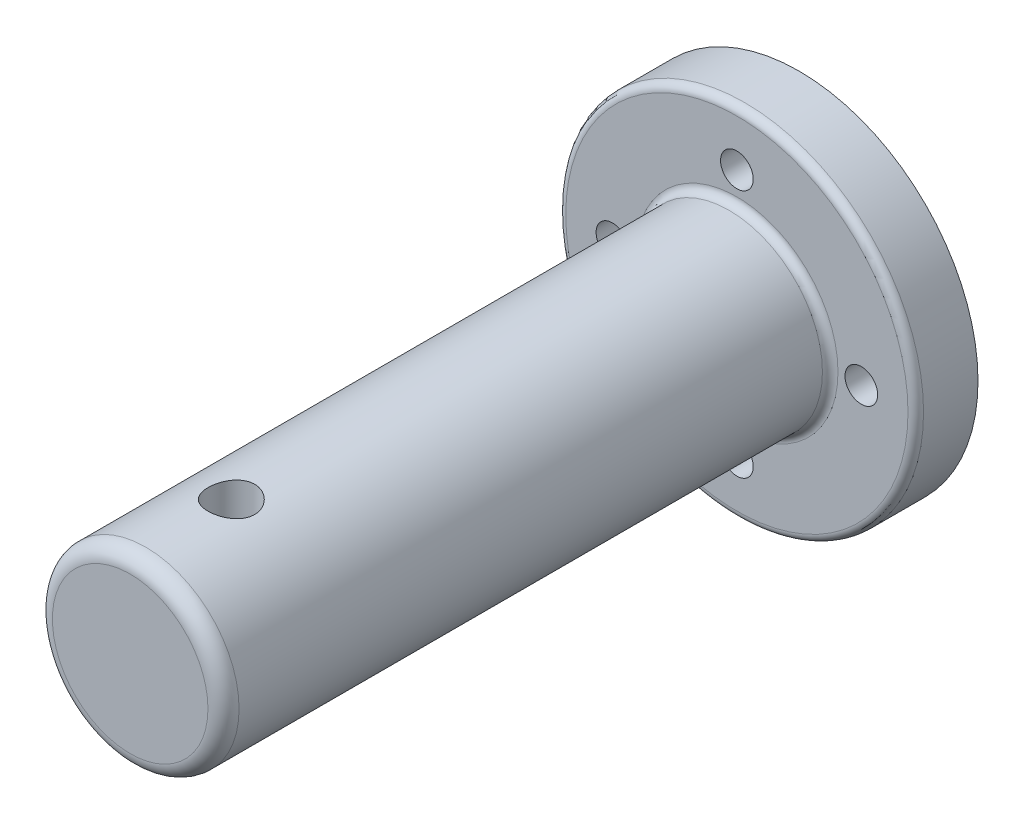
ISO-10303-21;
HEADER;
FILE_DESCRIPTION(('STEP AP214'),'2;1');
FILE_NAME('part.step','',(''),(''),'','','');
FILE_SCHEMA(('AUTOMOTIVE_DESIGN { 1 0 10303 214 1 1 1 1 }'));
ENDSEC;
DATA;
#1=APPLICATION_CONTEXT('core data for automotive mechanical design processes');
#2=APPLICATION_PROTOCOL_DEFINITION('international standard','automotive_design',2000,#1);
#3=PRODUCT_CONTEXT('',#1,'mechanical');
#4=PRODUCT('Part','Part','',(#3));
#5=PRODUCT_RELATED_PRODUCT_CATEGORY('part','',(#4));
#6=PRODUCT_DEFINITION_FORMATION('','',#4);
#7=PRODUCT_DEFINITION_CONTEXT('part definition',#1,'design');
#8=PRODUCT_DEFINITION('design','',#6,#7);
#9=PRODUCT_DEFINITION_SHAPE('','',#8);
#10=(LENGTH_UNIT() NAMED_UNIT(*) SI_UNIT(.MILLI.,.METRE.));
#11=(NAMED_UNIT(*) PLANE_ANGLE_UNIT() SI_UNIT($,.RADIAN.));
#12=(NAMED_UNIT(*) SI_UNIT($,.STERADIAN.) SOLID_ANGLE_UNIT());
#13=UNCERTAINTY_MEASURE_WITH_UNIT(LENGTH_MEASURE(1.E-05),#10,'distance_accuracy_value','');
#14=(GEOMETRIC_REPRESENTATION_CONTEXT(3) GLOBAL_UNCERTAINTY_ASSIGNED_CONTEXT((#13)) GLOBAL_UNIT_ASSIGNED_CONTEXT((#10,
#11,#12)) REPRESENTATION_CONTEXT('',''));
#15=CARTESIAN_POINT('',(0.,0.,0.));
#16=DIRECTION('',(0.,0.,1.));
#17=DIRECTION('',(1.,0.,0.));
#18=AXIS2_PLACEMENT_3D('',#15,#16,#17);
#19=CARTESIAN_POINT('',(0.,8.,4.));
#20=DIRECTION('',(0.,0.,-1.));
#21=DIRECTION('',(-1.,0.,0.));
#22=AXIS2_PLACEMENT_3D('',#19,#20,#21);
#23=CYLINDRICAL_SURFACE('',#22,1.05);
#24=CARTESIAN_POINT('',(0.,8.,4.));
#25=DIRECTION('',(0.,0.,1.));
#26=DIRECTION('',(1.,0.,0.));
#27=AXIS2_PLACEMENT_3D('',#24,#25,#26);
#28=CIRCLE('',#27,1.05);
#29=CARTESIAN_POINT('',(1.05,8.,4.));
#30=VERTEX_POINT('',#29);
#31=EDGE_CURVE('E205',#30,#30,#28,.T.);
#32=ORIENTED_EDGE('',*,*,#31,.T.);
#33=EDGE_LOOP('',(#32));
#34=FACE_BOUND('',#33,.T.);
#35=CARTESIAN_POINT('',(0.,8.,0.));
#36=DIRECTION('',(0.,0.,1.));
#37=DIRECTION('',(1.,0.,0.));
#38=AXIS2_PLACEMENT_3D('',#35,#36,#37);
#39=CIRCLE('',#38,1.05);
#40=CARTESIAN_POINT('',(1.05,8.,0.));
#41=VERTEX_POINT('',#40);
#42=EDGE_CURVE('E210',#41,#41,#39,.T.);
#43=ORIENTED_EDGE('',*,*,#42,.F.);
#44=EDGE_LOOP('',(#43));
#45=FACE_BOUND('',#44,.T.);
#46=ADVANCED_FACE('F45',(#34,#45),#23,.F.);
#47=CARTESIAN_POINT('',(8.,0.,4.));
#48=DIRECTION('',(0.,0.,-1.));
#49=DIRECTION('',(-1.,0.,0.));
#50=AXIS2_PLACEMENT_3D('',#47,#48,#49);
#51=CYLINDRICAL_SURFACE('',#50,1.05);
#52=CARTESIAN_POINT('',(8.,0.,4.));
#53=DIRECTION('',(0.,0.,1.));
#54=DIRECTION('',(1.,0.,0.));
#55=AXIS2_PLACEMENT_3D('',#52,#53,#54);
#56=CIRCLE('',#55,1.05);
#57=CARTESIAN_POINT('',(9.05,0.,4.));
#58=VERTEX_POINT('',#57);
#59=EDGE_CURVE('E363',#58,#58,#56,.T.);
#60=ORIENTED_EDGE('',*,*,#59,.T.);
#61=EDGE_LOOP('',(#60));
#62=FACE_BOUND('',#61,.T.);
#63=CARTESIAN_POINT('',(8.,0.,0.));
#64=DIRECTION('',(0.,0.,1.));
#65=DIRECTION('',(1.,0.,0.));
#66=AXIS2_PLACEMENT_3D('',#63,#64,#65);
#67=CIRCLE('',#66,1.05);
#68=CARTESIAN_POINT('',(9.05,0.,0.));
#69=VERTEX_POINT('',#68);
#70=EDGE_CURVE('E202',#69,#69,#67,.T.);
#71=ORIENTED_EDGE('',*,*,#70,.F.);
#72=EDGE_LOOP('',(#71));
#73=FACE_BOUND('',#72,.T.);
#74=ADVANCED_FACE('F154',(#62,#73),#51,.F.);
#75=CARTESIAN_POINT('',(0.,-8.,4.));
#76=DIRECTION('',(0.,0.,-1.));
#77=DIRECTION('',(-1.,0.,0.));
#78=AXIS2_PLACEMENT_3D('',#75,#76,#77);
#79=CYLINDRICAL_SURFACE('',#78,1.05);
#80=CARTESIAN_POINT('',(0.,-8.,4.));
#81=DIRECTION('',(0.,0.,1.));
#82=DIRECTION('',(1.,0.,0.));
#83=AXIS2_PLACEMENT_3D('',#80,#81,#82);
#84=CIRCLE('',#83,1.05);
#85=CARTESIAN_POINT('',(1.04999999999994,-8.,4.));
#86=VERTEX_POINT('',#85);
#87=EDGE_CURVE('E359',#86,#86,#84,.T.);
#88=ORIENTED_EDGE('',*,*,#87,.T.);
#89=EDGE_LOOP('',(#88));
#90=FACE_BOUND('',#89,.T.);
#91=CARTESIAN_POINT('',(0.,-8.,0.));
#92=DIRECTION('',(0.,0.,1.));
#93=DIRECTION('',(1.,0.,0.));
#94=AXIS2_PLACEMENT_3D('',#91,#92,#93);
#95=CIRCLE('',#94,1.05);
#96=CARTESIAN_POINT('',(1.04999999999994,-8.,0.));
#97=VERTEX_POINT('',#96);
#98=EDGE_CURVE('E197',#97,#97,#95,.T.);
#99=ORIENTED_EDGE('',*,*,#98,.F.);
#100=EDGE_LOOP('',(#99));
#101=FACE_BOUND('',#100,.T.);
#102=ADVANCED_FACE('F158',(#90,#101),#79,.F.);
#103=CARTESIAN_POINT('',(-8.,0.,4.));
#104=DIRECTION('',(0.,0.,-1.));
#105=DIRECTION('',(-1.,0.,0.));
#106=AXIS2_PLACEMENT_3D('',#103,#104,#105);
#107=CYLINDRICAL_SURFACE('',#106,1.05);
#108=CARTESIAN_POINT('',(-8.,0.,4.));
#109=DIRECTION('',(0.,0.,1.));
#110=DIRECTION('',(1.,0.,0.));
#111=AXIS2_PLACEMENT_3D('',#108,#109,#110);
#112=CIRCLE('',#111,1.05);
#113=CARTESIAN_POINT('',(-6.95,0.,4.));
#114=VERTEX_POINT('',#113);
#115=EDGE_CURVE('E216',#114,#114,#112,.T.);
#116=ORIENTED_EDGE('',*,*,#115,.T.);
#117=EDGE_LOOP('',(#116));
#118=FACE_BOUND('',#117,.T.);
#119=CARTESIAN_POINT('',(-8.,0.,0.));
#120=DIRECTION('',(0.,0.,1.));
#121=DIRECTION('',(1.,0.,0.));
#122=AXIS2_PLACEMENT_3D('',#119,#120,#121);
#123=CIRCLE('',#122,1.05);
#124=CARTESIAN_POINT('',(-6.95,0.,0.));
#125=VERTEX_POINT('',#124);
#126=EDGE_CURVE('E195',#125,#125,#123,.T.);
#127=ORIENTED_EDGE('',*,*,#126,.F.);
#128=EDGE_LOOP('',(#127));
#129=FACE_BOUND('',#128,.T.);
#130=ADVANCED_FACE('F150',(#118,#129),#107,.F.);
#131=CARTESIAN_POINT('',(0.,0.,4.));
#132=DIRECTION('',(0.,0.,-1.));
#133=DIRECTION('',(-1.,0.,0.));
#134=AXIS2_PLACEMENT_3D('',#131,#132,#133);
#135=CYLINDRICAL_SURFACE('',#134,11.5);
#136=CARTESIAN_POINT('',(0.,0.,3.5));
#137=DIRECTION('',(0.,0.,1.));
#138=DIRECTION('',(1.,0.,0.));
#139=AXIS2_PLACEMENT_3D('',#136,#137,#138);
#140=CIRCLE('',#139,11.5);
#141=CARTESIAN_POINT('',(11.5,0.,3.5));
#142=VERTEX_POINT('',#141);
#143=EDGE_CURVE('E223',#142,#142,#140,.F.);
#144=ORIENTED_EDGE('',*,*,#143,.T.);
#145=EDGE_LOOP('',(#144));
#146=FACE_BOUND('',#145,.T.);
#147=CARTESIAN_POINT('',(0.,0.,0.));
#148=DIRECTION('',(0.,0.,1.));
#149=DIRECTION('',(1.,0.,0.));
#150=AXIS2_PLACEMENT_3D('',#147,#148,#149);
#151=CIRCLE('',#150,11.5);
#152=CARTESIAN_POINT('',(11.5,0.,0.));
#153=VERTEX_POINT('',#152);
#154=EDGE_CURVE('E213',#153,#153,#151,.T.);
#155=ORIENTED_EDGE('',*,*,#154,.T.);
#156=EDGE_LOOP('',(#155));
#157=FACE_BOUND('',#156,.T.);
#158=ADVANCED_FACE('F144',(#146,#157),#135,.T.);
#159=CARTESIAN_POINT('',(0.,0.,4.));
#160=DIRECTION('',(0.,0.,1.));
#161=DIRECTION('',(1.,0.,0.));
#162=AXIS2_PLACEMENT_3D('',#159,#160,#161);
#163=PLANE('',#162);
#164=CARTESIAN_POINT('',(0.,0.,4.));
#165=DIRECTION('',(0.,0.,1.));
#166=DIRECTION('',(1.,0.,0.));
#167=AXIS2_PLACEMENT_3D('',#164,#165,#166);
#168=CIRCLE('',#167,11.);
#169=CARTESIAN_POINT('',(11.,0.,4.));
#170=VERTEX_POINT('',#169);
#171=EDGE_CURVE('E220',#170,#170,#168,.T.);
#172=ORIENTED_EDGE('',*,*,#171,.T.);
#173=EDGE_LOOP('',(#172));
#174=FACE_BOUND('',#173,.T.);
#175=CARTESIAN_POINT('',(0.,0.,4.));
#176=DIRECTION('',(0.,0.,1.));
#177=DIRECTION('',(1.,0.,0.));
#178=AXIS2_PLACEMENT_3D('',#175,#176,#177);
#179=CIRCLE('',#178,6.5);
#180=CARTESIAN_POINT('',(6.5,0.,4.));
#181=VERTEX_POINT('',#180);
#182=EDGE_CURVE('E217',#181,#181,#179,.F.);
#183=ORIENTED_EDGE('',*,*,#182,.T.);
#184=EDGE_LOOP('',(#183));
#185=FACE_BOUND('',#184,.T.);
#186=ORIENTED_EDGE('',*,*,#115,.F.);
#187=EDGE_LOOP('',(#186));
#188=FACE_BOUND('',#187,.T.);
#189=ORIENTED_EDGE('',*,*,#87,.F.);
#190=EDGE_LOOP('',(#189));
#191=FACE_BOUND('',#190,.T.);
#192=ORIENTED_EDGE('',*,*,#59,.F.);
#193=EDGE_LOOP('',(#192));
#194=FACE_BOUND('',#193,.T.);
#195=ORIENTED_EDGE('',*,*,#31,.F.);
#196=EDGE_LOOP('',(#195));
#197=FACE_BOUND('',#196,.T.);
#198=ADVANCED_FACE('F140',(#174,#185,#188,#191,#194,#197),#163,.T.);
#199=CARTESIAN_POINT('',(0.,0.,0.));
#200=DIRECTION('',(0.,0.,1.));
#201=DIRECTION('',(1.,0.,0.));
#202=AXIS2_PLACEMENT_3D('',#199,#200,#201);
#203=PLANE('',#202);
#204=CARTESIAN_POINT('',(0.,0.,0.));
#205=DIRECTION('',(0.,0.,1.));
#206=DIRECTION('',(1.,0.,0.));
#207=AXIS2_PLACEMENT_3D('',#204,#205,#206);
#208=CIRCLE('',#207,5.25);
#209=CARTESIAN_POINT('',(5.25,0.,0.));
#210=VERTEX_POINT('',#209);
#211=EDGE_CURVE('E67',#210,#210,#208,.T.);
#212=ORIENTED_EDGE('',*,*,#211,.T.);
#213=EDGE_LOOP('',(#212));
#214=FACE_BOUND('',#213,.T.);
#215=ORIENTED_EDGE('',*,*,#126,.T.);
#216=EDGE_LOOP('',(#215));
#217=FACE_BOUND('',#216,.T.);
#218=ORIENTED_EDGE('',*,*,#98,.T.);
#219=EDGE_LOOP('',(#218));
#220=FACE_BOUND('',#219,.T.);
#221=ORIENTED_EDGE('',*,*,#70,.T.);
#222=EDGE_LOOP('',(#221));
#223=FACE_BOUND('',#222,.T.);
#224=ORIENTED_EDGE('',*,*,#42,.T.);
#225=EDGE_LOOP('',(#224));
#226=FACE_BOUND('',#225,.T.);
#227=ORIENTED_EDGE('',*,*,#154,.F.);
#228=EDGE_LOOP('',(#227));
#229=FACE_BOUND('',#228,.T.);
#230=ADVANCED_FACE('F138',(#214,#217,#220,#223,#226,#229),#203,.F.);
#231=CARTESIAN_POINT('',(0.,0.,43.));
#232=DIRECTION('',(0.,0.,-1.));
#233=DIRECTION('',(-1.,0.,0.));
#234=AXIS2_PLACEMENT_3D('',#231,#232,#233);
#235=CYLINDRICAL_SURFACE('',#234,6.);
#236=CARTESIAN_POINT('',(0.,-6.,38.));
#237=CARTESIAN_POINT('',(0.0828760886697315,-5.99999859868013,37.9999976742618));
#238=CARTESIAN_POINT('',(0.165778157830764,-5.99826578131828,37.9931084492262));
#239=CARTESIAN_POINT('',(0.329206323770533,-5.99152113829892,37.965774848693));
#240=CARTESIAN_POINT('',(0.40973104687074,-5.98650745419968,37.9453227904621));
#241=CARTESIAN_POINT('',(0.566020872182579,-5.9737562633204,37.8915607465379));
#242=CARTESIAN_POINT('',(0.641791563430005,-5.96602202842087,37.8582662012847));
#243=CARTESIAN_POINT('',(0.786672131904428,-5.94865343807593,37.7798186099552));
#244=CARTESIAN_POINT('',(0.855781784348762,-5.9390190185405,37.7346651638811));
#245=CARTESIAN_POINT('',(0.986801927300923,-5.91867413591801,37.6327992103458));
#246=CARTESIAN_POINT('',(1.04855569006107,-5.90794707148533,37.5758884250408));
#247=CARTESIAN_POINT('',(1.16174892720331,-5.88673620117529,37.4525477950911));
#248=CARTESIAN_POINT('',(1.21318723694914,-5.87625242288348,37.3861168770535));
#249=CARTESIAN_POINT('',(1.30502654279903,-5.8565477569971,37.2444047732626));
#250=CARTESIAN_POINT('',(1.34525221592536,-5.84734794470605,37.1690067691896));
#251=CARTESIAN_POINT('',(1.41239690855053,-5.83149494812223,37.0122515883416));
#252=CARTESIAN_POINT('',(1.43931805543933,-5.82484135672789,36.9308953666742));
#253=CARTESIAN_POINT('',(1.47855483680429,-5.81500476717551,36.7662565017975));
#254=CARTESIAN_POINT('',(1.49115226833334,-5.81175491075426,36.6830451039502));
#255=CARTESIAN_POINT('',(1.50226177506785,-5.80889362537741,36.515631430986));
#256=CARTESIAN_POINT('',(1.50077614181798,-5.80928160448644,36.4314293193014));
#257=CARTESIAN_POINT('',(1.48398652463928,-5.81359205496618,36.2665841922555));
#258=CARTESIAN_POINT('',(1.46901834019052,-5.81742863001879,36.1859043785349));
#259=CARTESIAN_POINT('',(1.42622418690311,-5.82806709676484,36.0282389490887));
#260=CARTESIAN_POINT('',(1.39839730206943,-5.83486919970696,35.951253596971));
#261=CARTESIAN_POINT('',(1.33038947793716,-5.85075113904187,35.8022619837479));
#262=CARTESIAN_POINT('',(1.29008666723291,-5.85985327469421,35.7303138282104));
#263=CARTESIAN_POINT('',(1.19835627601495,-5.87929710846386,35.5940812902432));
#264=CARTESIAN_POINT('',(1.14692674880884,-5.88963902334735,35.5297982519327));
#265=CARTESIAN_POINT('',(1.03266342468122,-5.91075880539781,35.4087963843056));
#266=CARTESIAN_POINT('',(0.969546258165858,-5.92154069477971,35.3523455099386));
#267=CARTESIAN_POINT('',(0.834611917503701,-5.94205965578786,35.2507787575361));
#268=CARTESIAN_POINT('',(0.762794477707945,-5.95179669549415,35.2056632257364));
#269=CARTESIAN_POINT('',(0.612115888681392,-5.96917732094182,35.1279494137756));
#270=CARTESIAN_POINT('',(0.533231393208623,-5.97681360127725,35.0953946597456));
#271=CARTESIAN_POINT('',(0.37087600814288,-5.98907916991419,35.0440826942904));
#272=CARTESIAN_POINT('',(0.287405999150481,-5.99370903339281,35.0253228435819));
#273=CARTESIAN_POINT('',(0.120539970390023,-5.99935499271375,35.0025424344412));
#274=CARTESIAN_POINT('',(0.0371967199882068,-6.00046053508279,34.9981569739247));
#275=CARTESIAN_POINT('',(-0.12903287480151,-5.99918804814451,35.0032490020555));
#276=CARTESIAN_POINT('',(-0.211919259644596,-5.99681033241847,35.0127252427991));
#277=CARTESIAN_POINT('',(-0.373614268776493,-5.98889581127357,35.0449709083914));
#278=CARTESIAN_POINT('',(-0.452465118968756,-5.98340634185811,35.067541263477));
#279=CARTESIAN_POINT('',(-0.605257292452513,-5.96988706634134,35.1251070840284));
#280=CARTESIAN_POINT('',(-0.679198119032635,-5.96185700369892,35.1601038043132));
#281=CARTESIAN_POINT('',(-0.821523134429848,-5.9439330792631,35.2422361288747));
#282=CARTESIAN_POINT('',(-0.889785441835833,-5.93400867366932,35.2895761123968));
#283=CARTESIAN_POINT('',(-1.01752661364325,-5.91344509187419,35.394789908797));
#284=CARTESIAN_POINT('',(-1.07700395897301,-5.90280579251705,35.4526655396169));
#285=CARTESIAN_POINT('',(-1.18699056807273,-5.88168956960771,35.5790019608445));
#286=CARTESIAN_POINT('',(-1.23724386762203,-5.87122304187281,35.6476877030024));
#287=CARTESIAN_POINT('',(-1.3255107590127,-5.85192878377239,35.7927326344657));
#288=CARTESIAN_POINT('',(-1.36352489415794,-5.84310098067026,35.8690914829598));
#289=CARTESIAN_POINT('',(-1.42595142060929,-5.82818094734665,36.0269057224131));
#290=CARTESIAN_POINT('',(-1.45044439665407,-5.82207255291906,36.108327628344));
#291=CARTESIAN_POINT('',(-1.48534565995378,-5.81326744090183,36.2743096378891));
#292=CARTESIAN_POINT('',(-1.49575702747866,-5.81056997719936,36.3588690510325));
#293=CARTESIAN_POINT('',(-1.50203859033399,-5.80894901203957,36.5261210238552));
#294=CARTESIAN_POINT('',(-1.49831789778012,-5.80991932728264,36.6087974351247));
#295=CARTESIAN_POINT('',(-1.47737727831287,-5.81527909007843,36.772303888668));
#296=CARTESIAN_POINT('',(-1.46015762268677,-5.81966846891857,36.8531339680136));
#297=CARTESIAN_POINT('',(-1.4129313194428,-5.83131260682723,37.0102084590654));
#298=CARTESIAN_POINT('',(-1.38300140468038,-5.8385501523631,37.0864773052402));
#299=CARTESIAN_POINT('',(-1.31126491360507,-5.85507755724829,37.2329653827137));
#300=CARTESIAN_POINT('',(-1.26945669003419,-5.86436770120773,37.3031837731869));
#301=CARTESIAN_POINT('',(-1.17386774863714,-5.88425634263512,37.437554629002));
#302=CARTESIAN_POINT('',(-1.11980316291226,-5.89488264831757,37.501501073424));
#303=CARTESIAN_POINT('',(-1.00178937118973,-5.91608027246286,37.6195470447954));
#304=CARTESIAN_POINT('',(-0.937837821261143,-5.9266515772706,37.673644230113));
#305=CARTESIAN_POINT('',(-0.800467586702587,-5.94677655647663,37.7714113085646));
#306=CARTESIAN_POINT('',(-0.726898422316384,-5.95630833365868,37.8148746136716));
#307=CARTESIAN_POINT('',(-0.573266059510475,-5.97304924975119,37.8887474629405));
#308=CARTESIAN_POINT('',(-0.493207563436738,-5.98026005199781,37.9191663606485));
#309=CARTESIAN_POINT('',(-0.344410253243471,-5.99048059565542,37.9615718303297));
#310=CARTESIAN_POINT('',(-0.276380170908068,-5.99402585052691,37.9759512430534));
#311=CARTESIAN_POINT('',(-0.138906071536283,-5.99878605231948,37.9951659436219));
#312=CARTESIAN_POINT('',(-0.0694621612426162,-6.00000117450894,38.0000019493053));
#313=CARTESIAN_POINT('',(0.,-6.,38.));
#314=B_SPLINE_CURVE_WITH_KNOTS('',3,(#236,#237,#238,#239,#240,#241,#242,#243,#244,#245,#246,
#247,#248,#249,#250,#251,#252,#253,#254,#255,#256,#257,#258,#259,#260,#261,#262,#263,#264,#265,
#266,#267,#268,#269,#270,#271,#272,#273,#274,#275,#276,#277,#278,#279,#280,#281,#282,#283,#284,
#285,#286,#287,#288,#289,#290,#291,#292,#293,#294,#295,#296,#297,#298,#299,#300,#301,#302,#303,
#304,#305,#306,#307,#308,#309,#310,#311,#312,#313),.UNSPECIFIED.,.T.,.F.,(4,2,2,2,2,2,2,2,2,2,2,
2,2,2,2,2,2,2,2,2,2,2,2,2,2,2,2,2,2,2,2,2,2,2,2,2,2,2,4),(0.,0.248373712471891,0.4968882377639,
0.74510490228611,0.993329940169332,1.2461443543714,1.49898729580062,1.75558647545807,
2.01214461169369,2.2635629509943,2.51494038112697,2.76022497007017,3.00552703466038,
3.25330527873879,3.50112690836163,3.7560150096902,4.01091089558247,4.26668229009114,
4.52240473688643,4.77158308949277,5.02073901112743,5.26620274514038,5.51169127322291,
5.76153587565352,6.01142363008019,6.26744509204477,6.52345518749509,6.77792254614037,
7.03233423252409,7.27943780398613,7.52653640956034,7.77216400559448,8.01782568136901,
8.26989576409911,8.52202569770418,8.77872185499588,9.0352336382135,9.24342242942149,
9.4515955604304),.UNSPECIFIED.);
#315=CARTESIAN_POINT('',(0.,-6.,38.));
#316=VERTEX_POINT('',#315);
#317=EDGE_CURVE('E53',#316,#316,#314,.T.);
#318=ORIENTED_EDGE('',*,*,#317,.T.);
#319=EDGE_LOOP('',(#318));
#320=FACE_BOUND('',#319,.T.);
#321=CARTESIAN_POINT('',(0.,6.,38.));
#322=CARTESIAN_POINT('',(-0.0828760886697315,5.99999859868013,37.9999976742618));
#323=CARTESIAN_POINT('',(-0.165778157830764,5.99826578131828,37.9931084492262));
#324=CARTESIAN_POINT('',(-0.329206323770533,5.99152113829892,37.965774848693));
#325=CARTESIAN_POINT('',(-0.40973104687074,5.98650745419968,37.9453227904621));
#326=CARTESIAN_POINT('',(-0.566020872182579,5.9737562633204,37.8915607465379));
#327=CARTESIAN_POINT('',(-0.641791563430005,5.96602202842087,37.8582662012847));
#328=CARTESIAN_POINT('',(-0.786672131904428,5.94865343807593,37.7798186099552));
#329=CARTESIAN_POINT('',(-0.855781784348762,5.9390190185405,37.7346651638811));
#330=CARTESIAN_POINT('',(-0.986801927300923,5.91867413591801,37.6327992103458));
#331=CARTESIAN_POINT('',(-1.04855569006107,5.90794707148533,37.5758884250408));
#332=CARTESIAN_POINT('',(-1.16174892720331,5.88673620117529,37.4525477950911));
#333=CARTESIAN_POINT('',(-1.21318723694914,5.87625242288348,37.3861168770535));
#334=CARTESIAN_POINT('',(-1.30502654279903,5.8565477569971,37.2444047732626));
#335=CARTESIAN_POINT('',(-1.34525221592536,5.84734794470605,37.1690067691896));
#336=CARTESIAN_POINT('',(-1.41239690855053,5.83149494812223,37.0122515883416));
#337=CARTESIAN_POINT('',(-1.43931805543933,5.82484135672789,36.9308953666742));
#338=CARTESIAN_POINT('',(-1.47855483680429,5.81500476717551,36.7662565017975));
#339=CARTESIAN_POINT('',(-1.49115226833334,5.81175491075426,36.6830451039502));
#340=CARTESIAN_POINT('',(-1.50226177506785,5.80889362537741,36.515631430986));
#341=CARTESIAN_POINT('',(-1.50077614181798,5.80928160448644,36.4314293193014));
#342=CARTESIAN_POINT('',(-1.48398652463928,5.81359205496618,36.2665841922555));
#343=CARTESIAN_POINT('',(-1.46901834019052,5.81742863001879,36.1859043785349));
#344=CARTESIAN_POINT('',(-1.42622418690311,5.82806709676484,36.0282389490887));
#345=CARTESIAN_POINT('',(-1.39839730206943,5.83486919970696,35.951253596971));
#346=CARTESIAN_POINT('',(-1.33038947793716,5.85075113904187,35.8022619837479));
#347=CARTESIAN_POINT('',(-1.29008666723291,5.85985327469421,35.7303138282104));
#348=CARTESIAN_POINT('',(-1.19835627601495,5.87929710846386,35.5940812902432));
#349=CARTESIAN_POINT('',(-1.14692674880884,5.88963902334735,35.5297982519327));
#350=CARTESIAN_POINT('',(-1.03266342468122,5.91075880539781,35.4087963843056));
#351=CARTESIAN_POINT('',(-0.969546258165858,5.92154069477971,35.3523455099386));
#352=CARTESIAN_POINT('',(-0.834611917503701,5.94205965578786,35.2507787575361));
#353=CARTESIAN_POINT('',(-0.762794477707945,5.95179669549415,35.2056632257364));
#354=CARTESIAN_POINT('',(-0.612115888681392,5.96917732094182,35.1279494137756));
#355=CARTESIAN_POINT('',(-0.533231393208623,5.97681360127725,35.0953946597456));
#356=CARTESIAN_POINT('',(-0.37087600814288,5.98907916991419,35.0440826942904));
#357=CARTESIAN_POINT('',(-0.287405999150481,5.99370903339281,35.0253228435819));
#358=CARTESIAN_POINT('',(-0.120539970390023,5.99935499271375,35.0025424344412));
#359=CARTESIAN_POINT('',(-0.0371967199882068,6.00046053508279,34.9981569739247));
#360=CARTESIAN_POINT('',(0.12903287480151,5.99918804814451,35.0032490020555));
#361=CARTESIAN_POINT('',(0.211919259644596,5.99681033241847,35.0127252427991));
#362=CARTESIAN_POINT('',(0.373614268776493,5.98889581127357,35.0449709083914));
#363=CARTESIAN_POINT('',(0.452465118968756,5.98340634185811,35.067541263477));
#364=CARTESIAN_POINT('',(0.605257292452513,5.96988706634134,35.1251070840284));
#365=CARTESIAN_POINT('',(0.679198119032635,5.96185700369892,35.1601038043132));
#366=CARTESIAN_POINT('',(0.821523134429848,5.9439330792631,35.2422361288747));
#367=CARTESIAN_POINT('',(0.889785441835833,5.93400867366932,35.2895761123968));
#368=CARTESIAN_POINT('',(1.01752661364325,5.91344509187419,35.394789908797));
#369=CARTESIAN_POINT('',(1.07700395897301,5.90280579251705,35.4526655396169));
#370=CARTESIAN_POINT('',(1.18699056807273,5.88168956960771,35.5790019608445));
#371=CARTESIAN_POINT('',(1.23724386762203,5.87122304187281,35.6476877030024));
#372=CARTESIAN_POINT('',(1.3255107590127,5.85192878377239,35.7927326344657));
#373=CARTESIAN_POINT('',(1.36352489415794,5.84310098067026,35.8690914829598));
#374=CARTESIAN_POINT('',(1.42595142060929,5.82818094734665,36.0269057224131));
#375=CARTESIAN_POINT('',(1.45044439665407,5.82207255291906,36.108327628344));
#376=CARTESIAN_POINT('',(1.48534565995378,5.81326744090183,36.2743096378891));
#377=CARTESIAN_POINT('',(1.49575702747866,5.81056997719936,36.3588690510325));
#378=CARTESIAN_POINT('',(1.50203859033399,5.80894901203957,36.5261210238552));
#379=CARTESIAN_POINT('',(1.49831789778012,5.80991932728264,36.6087974351247));
#380=CARTESIAN_POINT('',(1.47737727831287,5.81527909007843,36.772303888668));
#381=CARTESIAN_POINT('',(1.46015762268677,5.81966846891857,36.8531339680136));
#382=CARTESIAN_POINT('',(1.4129313194428,5.83131260682723,37.0102084590654));
#383=CARTESIAN_POINT('',(1.38300140468038,5.8385501523631,37.0864773052402));
#384=CARTESIAN_POINT('',(1.31126491360507,5.85507755724829,37.2329653827137));
#385=CARTESIAN_POINT('',(1.26945669003419,5.86436770120773,37.3031837731869));
#386=CARTESIAN_POINT('',(1.17386774863714,5.88425634263512,37.437554629002));
#387=CARTESIAN_POINT('',(1.11980316291226,5.89488264831757,37.501501073424));
#388=CARTESIAN_POINT('',(1.00178937118973,5.91608027246286,37.6195470447954));
#389=CARTESIAN_POINT('',(0.937837821261143,5.9266515772706,37.673644230113));
#390=CARTESIAN_POINT('',(0.800467586702587,5.94677655647663,37.7714113085646));
#391=CARTESIAN_POINT('',(0.726898422316384,5.95630833365868,37.8148746136716));
#392=CARTESIAN_POINT('',(0.573266059510475,5.97304924975119,37.8887474629405));
#393=CARTESIAN_POINT('',(0.493207563436738,5.98026005199781,37.9191663606485));
#394=CARTESIAN_POINT('',(0.344410253243471,5.99048059565542,37.9615718303297));
#395=CARTESIAN_POINT('',(0.276380170908068,5.99402585052691,37.9759512430534));
#396=CARTESIAN_POINT('',(0.138906071536283,5.99878605231948,37.9951659436219));
#397=CARTESIAN_POINT('',(0.0694621612426162,6.00000117450894,38.0000019493053));
#398=CARTESIAN_POINT('',(0.,6.,38.));
#399=B_SPLINE_CURVE_WITH_KNOTS('',3,(#321,#322,#323,#324,#325,#326,#327,#328,#329,#330,#331,
#332,#333,#334,#335,#336,#337,#338,#339,#340,#341,#342,#343,#344,#345,#346,#347,#348,#349,#350,
#351,#352,#353,#354,#355,#356,#357,#358,#359,#360,#361,#362,#363,#364,#365,#366,#367,#368,#369,
#370,#371,#372,#373,#374,#375,#376,#377,#378,#379,#380,#381,#382,#383,#384,#385,#386,#387,#388,
#389,#390,#391,#392,#393,#394,#395,#396,#397,#398),.UNSPECIFIED.,.T.,.F.,(4,2,2,2,2,2,2,2,2,2,2,
2,2,2,2,2,2,2,2,2,2,2,2,2,2,2,2,2,2,2,2,2,2,2,2,2,2,2,4),(0.,0.248373712471891,0.4968882377639,
0.74510490228611,0.993329940169332,1.2461443543714,1.49898729580062,1.75558647545807,
2.01214461169369,2.2635629509943,2.51494038112697,2.76022497007017,3.00552703466038,
3.25330527873879,3.50112690836163,3.7560150096902,4.01091089558247,4.26668229009114,
4.52240473688643,4.77158308949277,5.02073901112743,5.26620274514038,5.51169127322291,
5.76153587565352,6.01142363008019,6.26744509204477,6.52345518749509,6.77792254614037,
7.03233423252409,7.27943780398613,7.52653640956034,7.77216400559448,8.01782568136901,
8.26989576409911,8.52202569770418,8.77872185499588,9.0352336382135,9.24342242942149,
9.4515955604304),.UNSPECIFIED.);
#400=CARTESIAN_POINT('',(0.,6.,38.));
#401=VERTEX_POINT('',#400);
#402=EDGE_CURVE('E124',#401,#401,#399,.T.);
#403=ORIENTED_EDGE('',*,*,#402,.T.);
#404=EDGE_LOOP('',(#403));
#405=FACE_BOUND('',#404,.T.);
#406=CARTESIAN_POINT('',(0.,0.,42.));
#407=DIRECTION('',(0.,0.,1.));
#408=DIRECTION('',(1.,0.,0.));
#409=AXIS2_PLACEMENT_3D('',#406,#407,#408);
#410=CIRCLE('',#409,6.);
#411=CARTESIAN_POINT('',(6.,0.,42.));
#412=VERTEX_POINT('',#411);
#413=EDGE_CURVE('E77',#412,#412,#410,.F.);
#414=ORIENTED_EDGE('',*,*,#413,.T.);
#415=EDGE_LOOP('',(#414));
#416=FACE_BOUND('',#415,.T.);
#417=CARTESIAN_POINT('',(0.,0.,4.5));
#418=DIRECTION('',(0.,0.,1.));
#419=DIRECTION('',(1.,0.,0.));
#420=AXIS2_PLACEMENT_3D('',#417,#418,#419);
#421=CIRCLE('',#420,6.);
#422=CARTESIAN_POINT('',(6.,0.,4.5));
#423=VERTEX_POINT('',#422);
#424=EDGE_CURVE('E226',#423,#423,#421,.T.);
#425=ORIENTED_EDGE('',*,*,#424,.T.);
#426=EDGE_LOOP('',(#425));
#427=FACE_BOUND('',#426,.T.);
#428=ADVANCED_FACE('F134',(#320,#405,#416,#427),#235,.T.);
#429=CARTESIAN_POINT('',(0.,0.,43.));
#430=DIRECTION('',(0.,0.,1.));
#431=DIRECTION('',(1.,0.,0.));
#432=AXIS2_PLACEMENT_3D('',#429,#430,#431);
#433=PLANE('',#432);
#434=CARTESIAN_POINT('',(0.,0.,43.));
#435=DIRECTION('',(0.,0.,1.));
#436=DIRECTION('',(1.,0.,0.));
#437=AXIS2_PLACEMENT_3D('',#434,#435,#436);
#438=CIRCLE('',#437,5.);
#439=CARTESIAN_POINT('',(5.,0.,43.));
#440=VERTEX_POINT('',#439);
#441=EDGE_CURVE('E229',#440,#440,#438,.T.);
#442=ORIENTED_EDGE('',*,*,#441,.T.);
#443=EDGE_LOOP('',(#442));
#444=FACE_BOUND('',#443,.T.);
#445=ADVANCED_FACE('F101',(#444),#433,.T.);
#446=CARTESIAN_POINT('',(0.,0.,9.));
#447=DIRECTION('',(0.,0.,-1.));
#448=DIRECTION('',(-1.,0.,0.));
#449=AXIS2_PLACEMENT_3D('',#446,#447,#448);
#450=CYLINDRICAL_SURFACE('',#449,4.25);
#451=CARTESIAN_POINT('',(-4.25,0.,2.));
#452=CARTESIAN_POINT('',(-4.25,0.556323668797347,2.));
#453=CARTESIAN_POINT('',(-4.13938386425417,1.11242853649843,2.));
#454=CARTESIAN_POINT('',(-3.71359216209177,2.14038063860483,2.));
#455=CARTESIAN_POINT('',(-3.39858405878381,2.61182358130185,2.));
#456=CARTESIAN_POINT('',(-2.61182358130185,3.39858405878381,2.));
#457=CARTESIAN_POINT('',(-2.14038063860481,3.71359216209177,2.));
#458=CARTESIAN_POINT('',(-1.11242853649845,4.13938386425416,2.));
#459=CARTESIAN_POINT('',(-0.556323668797074,4.25,2.));
#460=CARTESIAN_POINT('',(0.556323668797073,4.25,2.));
#461=CARTESIAN_POINT('',(1.11242853649847,4.13938386425415,2.));
#462=CARTESIAN_POINT('',(2.14038063860479,3.71359216209178,2.));
#463=CARTESIAN_POINT('',(2.61182358130185,3.39858405878381,2.));
#464=CARTESIAN_POINT('',(3.39858405878381,2.61182358130184,2.));
#465=CARTESIAN_POINT('',(3.71359216209176,2.14038063860484,2.));
#466=CARTESIAN_POINT('',(4.13938386425417,1.11242853649844,2.));
#467=CARTESIAN_POINT('',(4.25,0.556323668797074,2.));
#468=CARTESIAN_POINT('',(4.25,-0.556323668797073,2.));
#469=CARTESIAN_POINT('',(4.13938386425417,-1.11242853649843,2.));
#470=CARTESIAN_POINT('',(3.71359216209177,-2.14038063860482,2.));
#471=CARTESIAN_POINT('',(3.39858405878378,-2.61182358130187,2.));
#472=CARTESIAN_POINT('',(2.61182358130187,-3.39858405878379,2.));
#473=CARTESIAN_POINT('',(2.14038063860482,-3.71359216209177,2.));
#474=CARTESIAN_POINT('',(1.11242853649845,-4.13938386425416,2.));
#475=CARTESIAN_POINT('',(0.556323668797067,-4.25,2.));
#476=CARTESIAN_POINT('',(-0.556323668797081,-4.25,2.));
#477=CARTESIAN_POINT('',(-1.1124285364984,-4.13938386425418,2.));
#478=CARTESIAN_POINT('',(-2.14038063860485,-3.71359216209176,2.));
#479=CARTESIAN_POINT('',(-2.61182358130187,-3.39858405878378,2.));
#480=CARTESIAN_POINT('',(-3.39858405878377,-2.61182358130189,2.));
#481=CARTESIAN_POINT('',(-3.71359216209175,-2.14038063860486,2.));
#482=CARTESIAN_POINT('',(-4.13938386425418,-1.11242853649841,2.));
#483=CARTESIAN_POINT('',(-4.25,-0.556323668797348,2.));
#484=CARTESIAN_POINT('',(-4.25,0.,2.));
#485=(BOUNDED_CURVE() B_SPLINE_CURVE(3,(#451,#452,#453,#454,#455,#456,#457,#458,#459,#460,#461,
#462,#463,#464,#465,#466,#467,#468,#469,#470,#471,#472,#473,#474,#475,#476,#477,#478,#479,#480,
#481,#482,#483,#484),.UNSPECIFIED.,.T.,.F.) B_SPLINE_CURVE_WITH_KNOTS((4,2,2,2,2,2,2,2,2,2,2,2,
2,2,2,2,4),(0.,0.392699081698724,0.785398163397448,1.17809724509617,1.5707963267949,
1.96349540849362,2.35619449019234,2.74889357189107,3.14159265358979,3.53429173528852,
3.92699081698724,4.31968989868597,4.71238898038469,5.10508806208341,5.49778714378214,
5.89048622548086,6.28318530717959),
.UNSPECIFIED.) CURVE() GEOMETRIC_REPRESENTATION_ITEM() RATIONAL_B_SPLINE_CURVE((1.,1.,1.,1.,1.,
1.,1.,1.,1.,1.,1.,1.,1.,1.,1.,1.,1.,1.,1.,1.,1.,1.,1.,1.,1.,1.,1.,1.,1.,1.,1.,1.,1.,1.)) REPRESENTATION_ITEM(''));
#486=CARTESIAN_POINT('',(-4.25,0.,2.));
#487=VERTEX_POINT('',#486);
#488=EDGE_CURVE('E11',#487,#487,#485,.F.);
#489=ORIENTED_EDGE('',*,*,#488,.T.);
#490=EDGE_LOOP('',(#489));
#491=FACE_BOUND('',#490,.T.);
#492=CARTESIAN_POINT('',(0.,0.,0.999999999999999));
#493=DIRECTION('',(0.,0.,1.));
#494=DIRECTION('',(1.,0.,0.));
#495=AXIS2_PLACEMENT_3D('',#492,#493,#494);
#496=CIRCLE('',#495,4.25);
#497=CARTESIAN_POINT('',(4.25,0.,0.999999999999999));
#498=VERTEX_POINT('',#497);
#499=EDGE_CURVE('E72',#498,#498,#496,.F.);
#500=ORIENTED_EDGE('',*,*,#499,.T.);
#501=EDGE_LOOP('',(#500));
#502=FACE_BOUND('',#501,.T.);
#503=ADVANCED_FACE('F95',(#491,#502),#450,.F.);
#504=CARTESIAN_POINT('',(0.,0.,9.));
#505=DIRECTION('',(0.,0.,-1.));
#506=DIRECTION('',(-1.,0.,0.));
#507=AXIS2_PLACEMENT_3D('',#504,#505,#506);
#508=PLANE('',#507);
#509=CARTESIAN_POINT('',(-1.75,0.,9.));
#510=CARTESIAN_POINT('',(-1.75,-0.229074451857732,9.));
#511=CARTESIAN_POINT('',(-1.70445217939878,-0.458058809146412,9.));
#512=CARTESIAN_POINT('',(-1.52912618439072,-0.881333204131407,9.));
#513=CARTESIAN_POINT('',(-1.39941696538156,-1.07545676877138,9.));
#514=CARTESIAN_POINT('',(-1.07545676877135,-1.39941696538155,9.));
#515=CARTESIAN_POINT('',(-0.881333204131402,-1.52912618439073,9.));
#516=CARTESIAN_POINT('',(-0.458058809146407,-1.70445217939878,9.));
#517=CARTESIAN_POINT('',(-0.229074451857622,-1.75,9.));
#518=CARTESIAN_POINT('',(0.229074451857616,-1.75,9.));
#519=CARTESIAN_POINT('',(0.458058809146412,-1.70445217939878,9.));
#520=CARTESIAN_POINT('',(0.881333204131407,-1.52912618439072,9.));
#521=CARTESIAN_POINT('',(1.07545676877135,-1.39941696538157,9.));
#522=CARTESIAN_POINT('',(1.39941696538157,-1.07545676877135,9.));
#523=CARTESIAN_POINT('',(1.52912618439073,-0.881333204131405,9.));
#524=CARTESIAN_POINT('',(1.70445217939877,-0.458058809146404,9.));
#525=CARTESIAN_POINT('',(1.75,-0.229074451857618,9.));
#526=CARTESIAN_POINT('',(1.75,0.229074451857619,9.));
#527=CARTESIAN_POINT('',(1.70445217939877,0.458058809146409,9.));
#528=CARTESIAN_POINT('',(1.52912618439073,0.88133320413141,9.));
#529=CARTESIAN_POINT('',(1.39941696538157,1.07545676877135,9.));
#530=CARTESIAN_POINT('',(1.07545676877135,1.39941696538157,9.));
#531=CARTESIAN_POINT('',(0.881333204131401,1.52912618439074,9.));
#532=CARTESIAN_POINT('',(0.458058809146415,1.70445217939876,9.));
#533=CARTESIAN_POINT('',(0.229074451857618,1.75,9.));
#534=CARTESIAN_POINT('',(-0.229074451857619,1.75,9.));
#535=CARTESIAN_POINT('',(-0.458058809146414,1.70445217939876,9.));
#536=CARTESIAN_POINT('',(-0.881333204131399,1.52912618439074,9.));
#537=CARTESIAN_POINT('',(-1.07545676877135,1.39941696538159,9.));
#538=CARTESIAN_POINT('',(-1.39941696538156,1.07545676877133,9.));
#539=CARTESIAN_POINT('',(-1.52912618439075,0.881333204131416,9.));
#540=CARTESIAN_POINT('',(-1.70445217939875,0.458058809146398,9.));
#541=CARTESIAN_POINT('',(-1.75,0.229074451857731,9.));
#542=CARTESIAN_POINT('',(-1.75,0.,9.));
#543=(BOUNDED_CURVE() B_SPLINE_CURVE(3,(#509,#510,#511,#512,#513,#514,#515,#516,#517,#518,#519,
#520,#521,#522,#523,#524,#525,#526,#527,#528,#529,#530,#531,#532,#533,#534,#535,#536,#537,#538,
#539,#540,#541,#542),.UNSPECIFIED.,.T.,.F.) B_SPLINE_CURVE_WITH_KNOTS((4,2,2,2,2,2,2,2,2,2,2,2,
2,2,2,2,4),(0.,0.392699081698725,0.785398163397448,1.17809724509617,1.5707963267949,
1.96349540849362,2.35619449019234,2.74889357189107,3.14159265358979,3.53429173528852,
3.92699081698724,4.31968989868597,4.71238898038469,5.10508806208341,5.49778714378214,
5.89048622548086,6.28318530717959),
.UNSPECIFIED.) CURVE() GEOMETRIC_REPRESENTATION_ITEM() RATIONAL_B_SPLINE_CURVE((1.,1.,1.,1.,1.,
1.,1.,1.,1.,1.,1.,1.,1.,1.,1.,1.,1.,1.,1.,1.,1.,1.,1.,1.,1.,1.,1.,1.,1.,1.,1.,1.,1.,1.)) REPRESENTATION_ITEM(''));
#544=CARTESIAN_POINT('',(-1.75,0.,9.));
#545=VERTEX_POINT('',#544);
#546=EDGE_CURVE('E62',#545,#545,#543,.F.);
#547=ORIENTED_EDGE('',*,*,#546,.T.);
#548=EDGE_LOOP('',(#547));
#549=FACE_BOUND('',#548,.T.);
#550=ADVANCED_FACE('F85',(#549),#508,.T.);
#551=CARTESIAN_POINT('',(0.,0.,3.5));
#552=DIRECTION('',(0.,0.,1.));
#553=DIRECTION('',(1.,0.,0.));
#554=AXIS2_PLACEMENT_3D('',#551,#552,#553);
#555=TOROIDAL_SURFACE('',#554,11.,0.5);
#556=ORIENTED_EDGE('',*,*,#143,.F.);
#557=EDGE_LOOP('',(#556));
#558=FACE_BOUND('',#557,.T.);
#559=ORIENTED_EDGE('',*,*,#171,.F.);
#560=EDGE_LOOP('',(#559));
#561=FACE_BOUND('',#560,.T.);
#562=ADVANCED_FACE('F94',(#558,#561),#555,.T.);
#563=CARTESIAN_POINT('',(0.,0.,4.5));
#564=DIRECTION('',(0.,0.,1.));
#565=DIRECTION('',(1.,0.,0.));
#566=AXIS2_PLACEMENT_3D('',#563,#564,#565);
#567=TOROIDAL_SURFACE('',#566,6.5,0.5);
#568=ORIENTED_EDGE('',*,*,#182,.F.);
#569=EDGE_LOOP('',(#568));
#570=FACE_BOUND('',#569,.T.);
#571=ORIENTED_EDGE('',*,*,#424,.F.);
#572=EDGE_LOOP('',(#571));
#573=FACE_BOUND('',#572,.T.);
#574=ADVANCED_FACE('F168',(#570,#573),#567,.F.);
#575=CARTESIAN_POINT('',(0.,0.,42.));
#576=DIRECTION('',(0.,0.,1.));
#577=DIRECTION('',(1.,0.,0.));
#578=AXIS2_PLACEMENT_3D('',#575,#576,#577);
#579=TOROIDAL_SURFACE('',#578,5.,1.);
#580=ORIENTED_EDGE('',*,*,#413,.F.);
#581=EDGE_LOOP('',(#580));
#582=FACE_BOUND('',#581,.T.);
#583=ORIENTED_EDGE('',*,*,#441,.F.);
#584=EDGE_LOOP('',(#583));
#585=FACE_BOUND('',#584,.T.);
#586=ADVANCED_FACE('F172',(#582,#585),#579,.T.);
#587=CARTESIAN_POINT('',(0.,0.,0.999999999999999));
#588=DIRECTION('',(0.,0.,1.));
#589=DIRECTION('',(1.,0.,0.));
#590=AXIS2_PLACEMENT_3D('',#587,#588,#589);
#591=TOROIDAL_SURFACE('',#590,5.25,1.);
#592=ORIENTED_EDGE('',*,*,#211,.F.);
#593=EDGE_LOOP('',(#592));
#594=FACE_BOUND('',#593,.T.);
#595=ORIENTED_EDGE('',*,*,#499,.F.);
#596=EDGE_LOOP('',(#595));
#597=FACE_BOUND('',#596,.T.);
#598=ADVANCED_FACE('F175',(#594,#597),#591,.T.);
#599=CARTESIAN_POINT('',(-1.75,0.,9.));
#600=CARTESIAN_POINT('',(-1.75,0.229074451857731,9.));
#601=CARTESIAN_POINT('',(-1.70445217939875,0.458058809146398,9.));
#602=CARTESIAN_POINT('',(-1.52912618439075,0.881333204131416,9.));
#603=CARTESIAN_POINT('',(-1.39941696538156,1.07545676877133,9.));
#604=CARTESIAN_POINT('',(-1.07545676877135,1.39941696538159,9.));
#605=CARTESIAN_POINT('',(-0.881333204131399,1.52912618439074,9.));
#606=CARTESIAN_POINT('',(-0.458058809146414,1.70445217939876,9.));
#607=CARTESIAN_POINT('',(-0.229074451857619,1.75,9.));
#608=CARTESIAN_POINT('',(0.229074451857618,1.75,9.));
#609=CARTESIAN_POINT('',(0.458058809146415,1.70445217939876,9.));
#610=CARTESIAN_POINT('',(0.881333204131401,1.52912618439074,9.));
#611=CARTESIAN_POINT('',(1.07545676877135,1.39941696538157,9.));
#612=CARTESIAN_POINT('',(1.39941696538157,1.07545676877135,9.));
#613=CARTESIAN_POINT('',(1.52912618439073,0.88133320413141,9.));
#614=CARTESIAN_POINT('',(1.70445217939877,0.458058809146409,9.));
#615=CARTESIAN_POINT('',(1.75,0.229074451857619,9.));
#616=CARTESIAN_POINT('',(1.75,-0.229074451857618,9.));
#617=CARTESIAN_POINT('',(1.70445217939877,-0.458058809146404,9.));
#618=CARTESIAN_POINT('',(1.52912618439073,-0.881333204131405,9.));
#619=CARTESIAN_POINT('',(1.39941696538157,-1.07545676877135,9.));
#620=CARTESIAN_POINT('',(1.07545676877135,-1.39941696538157,9.));
#621=CARTESIAN_POINT('',(0.881333204131407,-1.52912618439072,9.));
#622=CARTESIAN_POINT('',(0.458058809146412,-1.70445217939878,9.));
#623=CARTESIAN_POINT('',(0.229074451857616,-1.75,9.));
#624=CARTESIAN_POINT('',(-0.229074451857622,-1.75,9.));
#625=CARTESIAN_POINT('',(-0.458058809146407,-1.70445217939878,9.));
#626=CARTESIAN_POINT('',(-0.881333204131402,-1.52912618439073,9.));
#627=CARTESIAN_POINT('',(-1.07545676877135,-1.39941696538155,9.));
#628=CARTESIAN_POINT('',(-1.39941696538156,-1.07545676877138,9.));
#629=CARTESIAN_POINT('',(-1.52912618439072,-0.881333204131407,9.));
#630=CARTESIAN_POINT('',(-1.70445217939878,-0.458058809146412,9.));
#631=CARTESIAN_POINT('',(-1.75,-0.229074451857732,9.));
#632=CARTESIAN_POINT('',(-1.75,0.,9.));
#633=CARTESIAN_POINT('',(-4.25,0.,9.));
#634=CARTESIAN_POINT('',(-4.2500000000001,0.556323668797347,9.));
#635=CARTESIAN_POINT('',(-4.1393838642542,1.11242853649844,9.));
#636=CARTESIAN_POINT('',(-3.71359216209174,2.14038063860482,9.));
#637=CARTESIAN_POINT('',(-3.39858405878381,2.61182358130185,9.0000000000004));
#638=CARTESIAN_POINT('',(-2.61182358130185,3.39858405878381,8.9999999999996));
#639=CARTESIAN_POINT('',(-2.14038063860482,3.71359216209178,9.));
#640=CARTESIAN_POINT('',(-1.11242853649844,4.13938386425416,9.));
#641=CARTESIAN_POINT('',(-0.556323668797074,4.25,8.9999999999998));
#642=CARTESIAN_POINT('',(0.556323668797073,4.25,9.0000000000002));
#643=CARTESIAN_POINT('',(1.1124285364985,4.13938386425425,9.0000000000002));
#644=CARTESIAN_POINT('',(2.14038063860477,3.71359216209168,8.9999999999998));
#645=CARTESIAN_POINT('',(2.61182358130187,3.39858405878378,9.0000000000002));
#646=CARTESIAN_POINT('',(3.39858405878379,2.61182358130187,8.9999999999998));
#647=CARTESIAN_POINT('',(3.7135921620919,2.14038063860482,9.0000000000002));
#648=CARTESIAN_POINT('',(4.13938386425404,1.11242853649845,8.9999999999998));
#649=CARTESIAN_POINT('',(4.25,0.556323668797074,9.));
#650=CARTESIAN_POINT('',(4.25,-0.556323668797073,9.));
#651=CARTESIAN_POINT('',(4.13938386425434,-1.11242853649846,9.0000000000004));
#652=CARTESIAN_POINT('',(3.7135921620916,-2.14038063860479,8.9999999999996));
#653=CARTESIAN_POINT('',(3.39858405878378,-2.61182358130187,9.));
#654=CARTESIAN_POINT('',(2.61182358130187,-3.39858405878379,9.));
#655=CARTESIAN_POINT('',(2.14038063860482,-3.71359216209166,8.9999999999998));
#656=CARTESIAN_POINT('',(1.11242853649845,-4.13938386425427,9.0000000000002));
#657=CARTESIAN_POINT('',(0.556323668797067,-4.25,9.0000000000002));
#658=CARTESIAN_POINT('',(-0.556323668797081,-4.25,8.9999999999998));
#659=CARTESIAN_POINT('',(-1.11242853649844,-4.13938386425427,9.0000000000004));
#660=CARTESIAN_POINT('',(-2.14038063860481,-3.71359216209167,8.9999999999996));
#661=CARTESIAN_POINT('',(-2.61182358130187,-3.39858405878378,9.));
#662=CARTESIAN_POINT('',(-3.39858405878377,-2.61182358130189,9.));
#663=CARTESIAN_POINT('',(-3.71359216209166,-2.14038063860485,8.9999999999998));
#664=CARTESIAN_POINT('',(-4.13938386425427,-1.11242853649843,9.0000000000002));
#665=CARTESIAN_POINT('',(-4.2499999999999,-0.556323668797348,9.));
#666=CARTESIAN_POINT('',(-4.25,0.,9.));
#667=CARTESIAN_POINT('',(-4.25,0.,2.));
#668=CARTESIAN_POINT('',(-4.25,0.556323668797347,2.));
#669=CARTESIAN_POINT('',(-4.13938386425417,1.11242853649843,2.));
#670=CARTESIAN_POINT('',(-3.71359216209177,2.14038063860483,2.));
#671=CARTESIAN_POINT('',(-3.39858405878381,2.61182358130185,2.));
#672=CARTESIAN_POINT('',(-2.61182358130185,3.39858405878381,2.));
#673=CARTESIAN_POINT('',(-2.14038063860481,3.71359216209177,2.));
#674=CARTESIAN_POINT('',(-1.11242853649845,4.13938386425416,2.));
#675=CARTESIAN_POINT('',(-0.556323668797074,4.25,2.));
#676=CARTESIAN_POINT('',(0.556323668797073,4.25,2.));
#677=CARTESIAN_POINT('',(1.11242853649847,4.13938386425415,2.));
#678=CARTESIAN_POINT('',(2.14038063860479,3.71359216209178,2.));
#679=CARTESIAN_POINT('',(2.61182358130185,3.39858405878381,2.));
#680=CARTESIAN_POINT('',(3.39858405878381,2.61182358130184,2.));
#681=CARTESIAN_POINT('',(3.71359216209176,2.14038063860484,2.));
#682=CARTESIAN_POINT('',(4.13938386425417,1.11242853649844,2.));
#683=CARTESIAN_POINT('',(4.25,0.556323668797074,2.));
#684=CARTESIAN_POINT('',(4.25,-0.556323668797073,2.));
#685=CARTESIAN_POINT('',(4.13938386425417,-1.11242853649843,2.));
#686=CARTESIAN_POINT('',(3.71359216209177,-2.14038063860482,2.));
#687=CARTESIAN_POINT('',(3.39858405878378,-2.61182358130187,2.));
#688=CARTESIAN_POINT('',(2.61182358130187,-3.39858405878379,2.));
#689=CARTESIAN_POINT('',(2.14038063860482,-3.71359216209177,2.));
#690=CARTESIAN_POINT('',(1.11242853649845,-4.13938386425416,2.));
#691=CARTESIAN_POINT('',(0.556323668797067,-4.25,2.));
#692=CARTESIAN_POINT('',(-0.556323668797081,-4.25,2.));
#693=CARTESIAN_POINT('',(-1.1124285364984,-4.13938386425418,2.));
#694=CARTESIAN_POINT('',(-2.14038063860485,-3.71359216209176,2.));
#695=CARTESIAN_POINT('',(-2.61182358130187,-3.39858405878378,2.));
#696=CARTESIAN_POINT('',(-3.39858405878377,-2.61182358130189,2.));
#697=CARTESIAN_POINT('',(-3.71359216209175,-2.14038063860486,2.));
#698=CARTESIAN_POINT('',(-4.13938386425418,-1.11242853649841,2.));
#699=CARTESIAN_POINT('',(-4.25,-0.556323668797348,2.));
#700=CARTESIAN_POINT('',(-4.25,0.,2.));
#701=(BOUNDED_SURFACE() B_SPLINE_SURFACE(2,3,((#599,#600,#601,#602,#603,#604,#605,#606,#607,
#608,#609,#610,#611,#612,#613,#614,#615,#616,#617,#618,#619,#620,#621,#622,#623,#624,#625,#626,
#627,#628,#629,#630,#631,#632),(#633,#634,#635,#636,#637,#638,#639,#640,#641,#642,#643,#644,
#645,#646,#647,#648,#649,#650,#651,#652,#653,#654,#655,#656,#657,#658,#659,#660,#661,#662,#663,
#664,#665,#666),(#667,#668,#669,#670,#671,#672,#673,#674,#675,#676,#677,#678,#679,#680,#681,
#682,#683,#684,#685,#686,#687,#688,#689,#690,#691,#692,#693,#694,#695,#696,#697,#698,#699,
#700)),.UNSPECIFIED.,.F.,.T.,.F.) B_SPLINE_SURFACE_WITH_KNOTS((3,3),(4,2,2,2,2,2,2,2,2,2,2,2,2,
2,2,2,4),(0.,1.),(0.,0.392699081698724,0.785398163397448,1.17809724509617,1.5707963267949,
1.96349540849362,2.35619449019234,2.74889357189107,3.14159265358979,3.53429173528852,
3.92699081698724,4.31968989868597,4.71238898038469,5.10508806208341,5.49778714378214,
5.89048622548086,6.28318530717959),
.UNSPECIFIED.) GEOMETRIC_REPRESENTATION_ITEM() RATIONAL_B_SPLINE_SURFACE(((1.,1.,1.,1.,1.,1.,1.,
1.,1.,1.,1.,1.,1.,1.,1.,1.,1.,1.,1.,1.,1.,1.,1.,1.,1.,1.,1.,1.,1.,1.,1.,1.,1.,1.),
(0.707106781186548,0.707106781186548,0.707106781186548,0.707106781186548,0.707106781186548,
0.707106781186548,0.707106781186548,0.707106781186548,0.707106781186548,0.707106781186548,
0.707106781186548,0.707106781186548,0.707106781186548,0.707106781186548,0.707106781186548,
0.707106781186548,0.707106781186548,0.707106781186548,0.707106781186548,0.707106781186548,
0.707106781186548,0.707106781186548,0.707106781186548,0.707106781186548,0.707106781186548,
0.707106781186548,0.707106781186548,0.707106781186548,0.707106781186548,0.707106781186548,
0.707106781186548,0.707106781186548,0.707106781186548,0.707106781186548),(1.,1.,1.,1.,1.,1.,1.,
1.,1.,1.,1.,1.,1.,1.,1.,1.,1.,1.,1.,1.,1.,1.,1.,1.,1.,1.,1.,1.,1.,1.,1.,1.,1.,1.))) REPRESENTATION_ITEM('') SURFACE());
#702=ORIENTED_EDGE('',*,*,#488,.F.);
#703=EDGE_LOOP('',(#702));
#704=FACE_BOUND('',#703,.T.);
#705=ORIENTED_EDGE('',*,*,#546,.F.);
#706=EDGE_LOOP('',(#705));
#707=FACE_BOUND('',#706,.T.);
#708=ADVANCED_FACE('F48',(#704,#707),#701,.T.);
#709=CARTESIAN_POINT('',(0.,-11.5,36.5));
#710=DIRECTION('',(0.,1.,0.));
#711=DIRECTION('',(0.,0.,1.));
#712=AXIS2_PLACEMENT_3D('',#709,#710,#711);
#713=CYLINDRICAL_SURFACE('',#712,1.5);
#714=ORIENTED_EDGE('',*,*,#402,.F.);
#715=EDGE_LOOP('',(#714));
#716=FACE_BOUND('',#715,.T.);
#717=ORIENTED_EDGE('',*,*,#317,.F.);
#718=EDGE_LOOP('',(#717));
#719=FACE_BOUND('',#718,.T.);
#720=ADVANCED_FACE('F96',(#716,#719),#713,.F.);
#721=CLOSED_SHELL('',(#46,#74,#102,#130,#158,#198,#230,#428,#445,#503,#550,#562,#574,#586,#598,
#708,#720));
#722=MANIFOLD_SOLID_BREP('B2',#721);
#723=ADVANCED_BREP_SHAPE_REPRESENTATION('',(#18,#722),#14);
#724=SHAPE_DEFINITION_REPRESENTATION(#9,#723);
ENDSEC;
END-ISO-10303-21;
